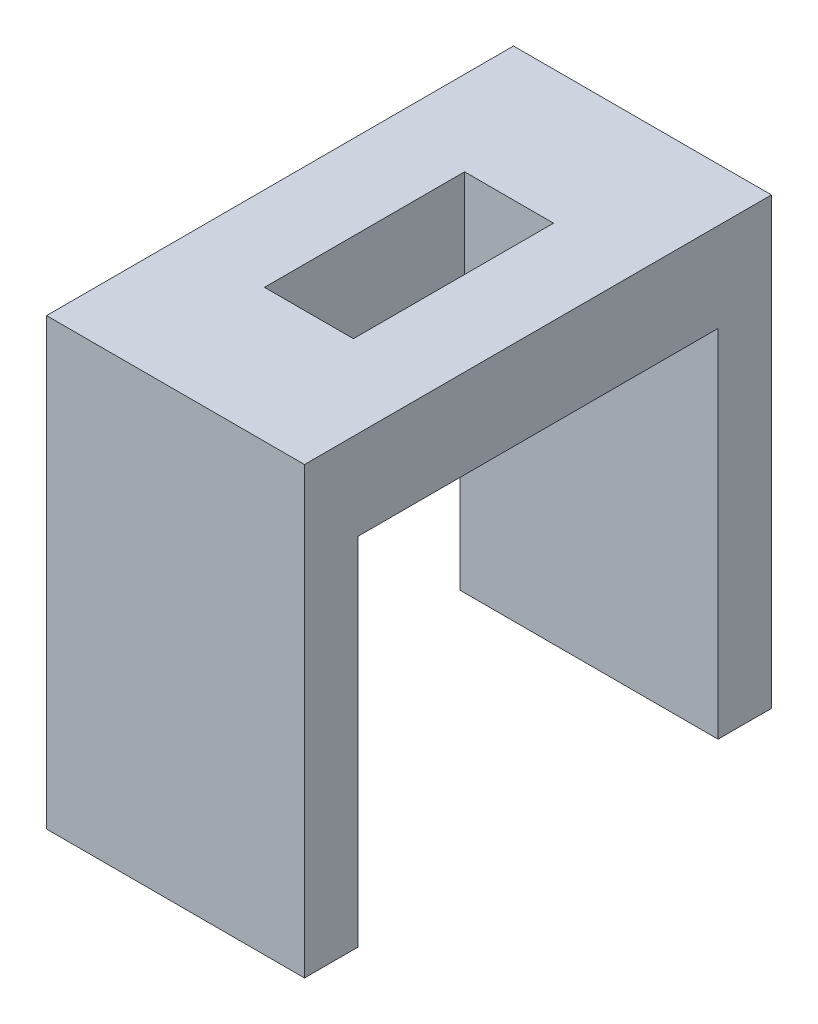
ISO-10303-21;
HEADER;
FILE_DESCRIPTION(('STEP AP214'),'2;1');
FILE_NAME('part.step','',(''),(''),'','','');
FILE_SCHEMA(('AUTOMOTIVE_DESIGN { 1 0 10303 214 1 1 1 1 }'));
ENDSEC;
DATA;
#1=APPLICATION_CONTEXT('core data for automotive mechanical design processes');
#2=APPLICATION_PROTOCOL_DEFINITION('international standard','automotive_design',2000,#1);
#3=PRODUCT_CONTEXT('',#1,'mechanical');
#4=PRODUCT('Part','Part','',(#3));
#5=PRODUCT_RELATED_PRODUCT_CATEGORY('part','',(#4));
#6=PRODUCT_DEFINITION_FORMATION('','',#4);
#7=PRODUCT_DEFINITION_CONTEXT('part definition',#1,'design');
#8=PRODUCT_DEFINITION('design','',#6,#7);
#9=PRODUCT_DEFINITION_SHAPE('','',#8);
#10=(LENGTH_UNIT() NAMED_UNIT(*) SI_UNIT(.MILLI.,.METRE.));
#11=(NAMED_UNIT(*) PLANE_ANGLE_UNIT() SI_UNIT($,.RADIAN.));
#12=(NAMED_UNIT(*) SI_UNIT($,.STERADIAN.) SOLID_ANGLE_UNIT());
#13=UNCERTAINTY_MEASURE_WITH_UNIT(LENGTH_MEASURE(1.E-05),#10,'distance_accuracy_value','');
#14=(GEOMETRIC_REPRESENTATION_CONTEXT(3) GLOBAL_UNCERTAINTY_ASSIGNED_CONTEXT((#13)) GLOBAL_UNIT_ASSIGNED_CONTEXT((#10,
#11,#12)) REPRESENTATION_CONTEXT('',''));
#15=CARTESIAN_POINT('',(0.,0.,0.));
#16=DIRECTION('',(0.,0.,1.));
#17=DIRECTION('',(1.,0.,0.));
#18=AXIS2_PLACEMENT_3D('',#15,#16,#17);
#19=CARTESIAN_POINT('',(0.,0.,0.));
#20=DIRECTION('',(0.,-1.,0.));
#21=DIRECTION('',(0.,0.,-1.));
#22=AXIS2_PLACEMENT_3D('',#19,#20,#21);
#23=PLANE('',#22);
#24=DIRECTION('',(-1.,0.,0.));
#25=VECTOR('',#24,1.);
#26=CARTESIAN_POINT('',(1.9,0.,-7.5));
#27=LINE('',#26,#25);
#28=CARTESIAN_POINT('',(3.9,0.,-7.5));
#29=VERTEX_POINT('',#28);
#30=CARTESIAN_POINT('',(1.9,0.,-7.5));
#31=VERTEX_POINT('',#30);
#32=EDGE_CURVE('E198',#29,#31,#27,.T.);
#33=ORIENTED_EDGE('',*,*,#32,.T.);
#34=DIRECTION('',(0.,0.,1.));
#35=VECTOR('',#34,1.);
#36=CARTESIAN_POINT('',(1.9,0.,-7.5));
#37=LINE('',#36,#35);
#38=CARTESIAN_POINT('',(1.9,0.,-3.));
#39=VERTEX_POINT('',#38);
#40=EDGE_CURVE('E181',#31,#39,#37,.T.);
#41=ORIENTED_EDGE('',*,*,#40,.T.);
#42=DIRECTION('',(1.,0.,0.));
#43=VECTOR('',#42,1.);
#44=CARTESIAN_POINT('',(1.9,0.,-3.));
#45=LINE('',#44,#43);
#46=CARTESIAN_POINT('',(3.9,0.,-3.));
#47=VERTEX_POINT('',#46);
#48=EDGE_CURVE('E185',#39,#47,#45,.T.);
#49=ORIENTED_EDGE('',*,*,#48,.T.);
#50=DIRECTION('',(0.,0.,-1.));
#51=VECTOR('',#50,1.);
#52=CARTESIAN_POINT('',(3.9,0.,-7.5));
#53=LINE('',#52,#51);
#54=EDGE_CURVE('E190',#47,#29,#53,.T.);
#55=ORIENTED_EDGE('',*,*,#54,.T.);
#56=EDGE_LOOP('',(#33,#41,#49,#55));
#57=FACE_BOUND('',#56,.T.);
#58=DIRECTION('',(0.,0.,-1.));
#59=VECTOR('',#58,1.);
#60=CARTESIAN_POINT('',(5.8,0.,0.));
#61=LINE('',#60,#59);
#62=CARTESIAN_POINT('',(5.8,0.,-1.2));
#63=VERTEX_POINT('',#62);
#64=CARTESIAN_POINT('',(5.8,0.,-9.3));
#65=VERTEX_POINT('',#64);
#66=EDGE_CURVE('E37',#63,#65,#61,.T.);
#67=ORIENTED_EDGE('',*,*,#66,.F.);
#68=DIRECTION('',(1.,0.,0.));
#69=VECTOR('',#68,1.);
#70=CARTESIAN_POINT('',(5.8,0.,-1.2));
#71=LINE('',#70,#69);
#72=CARTESIAN_POINT('',(0.,0.,-1.2));
#73=VERTEX_POINT('',#72);
#74=EDGE_CURVE('E143',#73,#63,#71,.T.);
#75=ORIENTED_EDGE('',*,*,#74,.F.);
#76=DIRECTION('',(0.,0.,1.));
#77=VECTOR('',#76,1.);
#78=CARTESIAN_POINT('',(0.,0.,0.));
#79=LINE('',#78,#77);
#80=CARTESIAN_POINT('',(0.,0.,-9.3));
#81=VERTEX_POINT('',#80);
#82=EDGE_CURVE('E173',#81,#73,#79,.T.);
#83=ORIENTED_EDGE('',*,*,#82,.F.);
#84=DIRECTION('',(-1.,0.,0.));
#85=VECTOR('',#84,1.);
#86=CARTESIAN_POINT('',(5.8,0.,-9.3));
#87=LINE('',#86,#85);
#88=EDGE_CURVE('E152',#65,#81,#87,.T.);
#89=ORIENTED_EDGE('',*,*,#88,.F.);
#90=EDGE_LOOP('',(#67,#75,#83,#89));
#91=FACE_BOUND('',#90,.T.);
#92=ADVANCED_FACE('F33',(#57,#91),#23,.T.);
#93=CARTESIAN_POINT('',(0.,2.,0.));
#94=DIRECTION('',(0.,-1.,0.));
#95=DIRECTION('',(0.,0.,-1.));
#96=AXIS2_PLACEMENT_3D('',#93,#94,#95);
#97=PLANE('',#96);
#98=DIRECTION('',(0.,0.,1.));
#99=VECTOR('',#98,1.);
#100=CARTESIAN_POINT('',(0.,2.,0.));
#101=LINE('',#100,#99);
#102=CARTESIAN_POINT('',(0.,2.,-10.5));
#103=VERTEX_POINT('',#102);
#104=CARTESIAN_POINT('',(0.,2.,0.));
#105=VERTEX_POINT('',#104);
#106=EDGE_CURVE('E210',#103,#105,#101,.T.);
#107=ORIENTED_EDGE('',*,*,#106,.T.);
#108=DIRECTION('',(1.,0.,0.));
#109=VECTOR('',#108,1.);
#110=CARTESIAN_POINT('',(0.,2.,0.));
#111=LINE('',#110,#109);
#112=CARTESIAN_POINT('',(5.8,2.,0.));
#113=VERTEX_POINT('',#112);
#114=EDGE_CURVE('E213',#105,#113,#111,.T.);
#115=ORIENTED_EDGE('',*,*,#114,.T.);
#116=DIRECTION('',(0.,0.,-1.));
#117=VECTOR('',#116,1.);
#118=CARTESIAN_POINT('',(5.8,2.,0.));
#119=LINE('',#118,#117);
#120=CARTESIAN_POINT('',(5.8,2.,-10.5));
#121=VERTEX_POINT('',#120);
#122=EDGE_CURVE('E128',#113,#121,#119,.T.);
#123=ORIENTED_EDGE('',*,*,#122,.T.);
#124=DIRECTION('',(-1.,0.,0.));
#125=VECTOR('',#124,1.);
#126=CARTESIAN_POINT('',(0.,2.,-10.5));
#127=LINE('',#126,#125);
#128=EDGE_CURVE('E216',#121,#103,#127,.T.);
#129=ORIENTED_EDGE('',*,*,#128,.T.);
#130=EDGE_LOOP('',(#107,#115,#123,#129));
#131=FACE_BOUND('',#130,.T.);
#132=DIRECTION('',(0.,0.,1.));
#133=VECTOR('',#132,1.);
#134=CARTESIAN_POINT('',(1.9,2.,-7.5));
#135=LINE('',#134,#133);
#136=CARTESIAN_POINT('',(1.9,2.,-7.5));
#137=VERTEX_POINT('',#136);
#138=CARTESIAN_POINT('',(1.9,2.,-3.));
#139=VERTEX_POINT('',#138);
#140=EDGE_CURVE('E167',#137,#139,#135,.T.);
#141=ORIENTED_EDGE('',*,*,#140,.F.);
#142=DIRECTION('',(-1.,0.,0.));
#143=VECTOR('',#142,1.);
#144=CARTESIAN_POINT('',(1.9,2.,-7.5));
#145=LINE('',#144,#143);
#146=CARTESIAN_POINT('',(3.9,2.,-7.5));
#147=VERTEX_POINT('',#146);
#148=EDGE_CURVE('E193',#147,#137,#145,.T.);
#149=ORIENTED_EDGE('',*,*,#148,.F.);
#150=DIRECTION('',(0.,0.,-1.));
#151=VECTOR('',#150,1.);
#152=CARTESIAN_POINT('',(3.9,2.,-7.5));
#153=LINE('',#152,#151);
#154=CARTESIAN_POINT('',(3.9,2.,-3.));
#155=VERTEX_POINT('',#154);
#156=EDGE_CURVE('E248',#155,#147,#153,.T.);
#157=ORIENTED_EDGE('',*,*,#156,.F.);
#158=DIRECTION('',(1.,0.,0.));
#159=VECTOR('',#158,1.);
#160=CARTESIAN_POINT('',(1.9,2.,-3.));
#161=LINE('',#160,#159);
#162=EDGE_CURVE('E244',#139,#155,#161,.T.);
#163=ORIENTED_EDGE('',*,*,#162,.F.);
#164=EDGE_LOOP('',(#141,#149,#157,#163));
#165=FACE_BOUND('',#164,.T.);
#166=ADVANCED_FACE('F236',(#131,#165),#97,.F.);
#167=CARTESIAN_POINT('',(0.,2.,0.));
#168=DIRECTION('',(1.,0.,0.));
#169=DIRECTION('',(0.,0.,-1.));
#170=AXIS2_PLACEMENT_3D('',#167,#168,#169);
#171=PLANE('',#170);
#172=DIRECTION('',(0.,-1.,0.));
#173=VECTOR('',#172,1.);
#174=CARTESIAN_POINT('',(0.,2.,-10.5));
#175=LINE('',#174,#173);
#176=CARTESIAN_POINT('',(0.,-8.,-10.5));
#177=VERTEX_POINT('',#176);
#178=EDGE_CURVE('E217',#103,#177,#175,.T.);
#179=ORIENTED_EDGE('',*,*,#178,.T.);
#180=DIRECTION('',(0.,0.,-1.));
#181=VECTOR('',#180,1.);
#182=CARTESIAN_POINT('',(0.,-8.,-10.5));
#183=LINE('',#182,#181);
#184=CARTESIAN_POINT('',(0.,-8.,-9.3));
#185=VERTEX_POINT('',#184);
#186=EDGE_CURVE('E158',#185,#177,#183,.T.);
#187=ORIENTED_EDGE('',*,*,#186,.F.);
#188=DIRECTION('',(0.,1.,0.));
#189=VECTOR('',#188,1.);
#190=CARTESIAN_POINT('',(0.,-8.,-9.3));
#191=LINE('',#190,#189);
#192=EDGE_CURVE('E164',#185,#81,#191,.T.);
#193=ORIENTED_EDGE('',*,*,#192,.T.);
#194=ORIENTED_EDGE('',*,*,#82,.T.);
#195=DIRECTION('',(0.,1.,0.));
#196=VECTOR('',#195,1.);
#197=CARTESIAN_POINT('',(0.,-8.,-1.2));
#198=LINE('',#197,#196);
#199=CARTESIAN_POINT('',(0.,-8.,-1.2));
#200=VERTEX_POINT('',#199);
#201=EDGE_CURVE('E150',#200,#73,#198,.T.);
#202=ORIENTED_EDGE('',*,*,#201,.F.);
#203=DIRECTION('',(0.,0.,-1.));
#204=VECTOR('',#203,1.);
#205=CARTESIAN_POINT('',(0.,-8.,0.));
#206=LINE('',#205,#204);
#207=CARTESIAN_POINT('',(0.,-8.,0.));
#208=VERTEX_POINT('',#207);
#209=EDGE_CURVE('E138',#208,#200,#206,.T.);
#210=ORIENTED_EDGE('',*,*,#209,.F.);
#211=DIRECTION('',(0.,-1.,0.));
#212=VECTOR('',#211,1.);
#213=CARTESIAN_POINT('',(0.,2.,0.));
#214=LINE('',#213,#212);
#215=EDGE_CURVE('E11',#105,#208,#214,.T.);
#216=ORIENTED_EDGE('',*,*,#215,.F.);
#217=ORIENTED_EDGE('',*,*,#106,.F.);
#218=EDGE_LOOP('',(#179,#187,#193,#194,#202,#210,#216,#217));
#219=FACE_BOUND('',#218,.T.);
#220=ADVANCED_FACE('F35',(#219),#171,.F.);
#221=CARTESIAN_POINT('',(0.,2.,0.));
#222=DIRECTION('',(0.,0.,-1.));
#223=DIRECTION('',(-1.,0.,0.));
#224=AXIS2_PLACEMENT_3D('',#221,#222,#223);
#225=PLANE('',#224);
#226=ORIENTED_EDGE('',*,*,#215,.T.);
#227=DIRECTION('',(-1.,0.,0.));
#228=VECTOR('',#227,1.);
#229=CARTESIAN_POINT('',(5.8,-8.,0.));
#230=LINE('',#229,#228);
#231=CARTESIAN_POINT('',(5.8,-8.,0.));
#232=VERTEX_POINT('',#231);
#233=EDGE_CURVE('E133',#232,#208,#230,.T.);
#234=ORIENTED_EDGE('',*,*,#233,.F.);
#235=DIRECTION('',(0.,-1.,0.));
#236=VECTOR('',#235,1.);
#237=CARTESIAN_POINT('',(5.8,2.,0.));
#238=LINE('',#237,#236);
#239=EDGE_CURVE('E43',#113,#232,#238,.T.);
#240=ORIENTED_EDGE('',*,*,#239,.F.);
#241=ORIENTED_EDGE('',*,*,#114,.F.);
#242=EDGE_LOOP('',(#226,#234,#240,#241));
#243=FACE_BOUND('',#242,.T.);
#244=ADVANCED_FACE('F134',(#243),#225,.F.);
#245=CARTESIAN_POINT('',(5.8,2.,0.));
#246=DIRECTION('',(-1.,0.,0.));
#247=DIRECTION('',(0.,0.,1.));
#248=AXIS2_PLACEMENT_3D('',#245,#246,#247);
#249=PLANE('',#248);
#250=ORIENTED_EDGE('',*,*,#239,.T.);
#251=DIRECTION('',(0.,0.,1.));
#252=VECTOR('',#251,1.);
#253=CARTESIAN_POINT('',(5.8,-8.,0.));
#254=LINE('',#253,#252);
#255=CARTESIAN_POINT('',(5.8,-8.,-1.2));
#256=VERTEX_POINT('',#255);
#257=EDGE_CURVE('E126',#256,#232,#254,.T.);
#258=ORIENTED_EDGE('',*,*,#257,.F.);
#259=DIRECTION('',(0.,1.,0.));
#260=VECTOR('',#259,1.);
#261=CARTESIAN_POINT('',(5.8,-8.,-1.2));
#262=LINE('',#261,#260);
#263=EDGE_CURVE('E51',#256,#63,#262,.T.);
#264=ORIENTED_EDGE('',*,*,#263,.T.);
#265=ORIENTED_EDGE('',*,*,#66,.T.);
#266=DIRECTION('',(0.,1.,0.));
#267=VECTOR('',#266,1.);
#268=CARTESIAN_POINT('',(5.8,-8.,-9.3));
#269=LINE('',#268,#267);
#270=CARTESIAN_POINT('',(5.8,-8.,-9.3));
#271=VERTEX_POINT('',#270);
#272=EDGE_CURVE('E177',#271,#65,#269,.T.);
#273=ORIENTED_EDGE('',*,*,#272,.F.);
#274=DIRECTION('',(0.,0.,1.));
#275=VECTOR('',#274,1.);
#276=CARTESIAN_POINT('',(5.8,-8.,-10.5));
#277=LINE('',#276,#275);
#278=CARTESIAN_POINT('',(5.8,-8.,-10.5));
#279=VERTEX_POINT('',#278);
#280=EDGE_CURVE('E153',#279,#271,#277,.T.);
#281=ORIENTED_EDGE('',*,*,#280,.F.);
#282=DIRECTION('',(0.,-1.,0.));
#283=VECTOR('',#282,1.);
#284=CARTESIAN_POINT('',(5.8,2.,-10.5));
#285=LINE('',#284,#283);
#286=EDGE_CURVE('E130',#121,#279,#285,.T.);
#287=ORIENTED_EDGE('',*,*,#286,.F.);
#288=ORIENTED_EDGE('',*,*,#122,.F.);
#289=EDGE_LOOP('',(#250,#258,#264,#265,#273,#281,#287,#288));
#290=FACE_BOUND('',#289,.T.);
#291=ADVANCED_FACE('F124',(#290),#249,.F.);
#292=CARTESIAN_POINT('',(0.,2.,-10.5));
#293=DIRECTION('',(0.,0.,1.));
#294=DIRECTION('',(1.,0.,0.));
#295=AXIS2_PLACEMENT_3D('',#292,#293,#294);
#296=PLANE('',#295);
#297=ORIENTED_EDGE('',*,*,#286,.T.);
#298=DIRECTION('',(1.,0.,0.));
#299=VECTOR('',#298,1.);
#300=CARTESIAN_POINT('',(5.8,-8.,-10.5));
#301=LINE('',#300,#299);
#302=EDGE_CURVE('E161',#177,#279,#301,.T.);
#303=ORIENTED_EDGE('',*,*,#302,.F.);
#304=ORIENTED_EDGE('',*,*,#178,.F.);
#305=ORIENTED_EDGE('',*,*,#128,.F.);
#306=EDGE_LOOP('',(#297,#303,#304,#305));
#307=FACE_BOUND('',#306,.T.);
#308=ADVANCED_FACE('F225',(#307),#296,.F.);
#309=CARTESIAN_POINT('',(1.9,2.,-7.5));
#310=DIRECTION('',(1.,0.,0.));
#311=DIRECTION('',(0.,0.,-1.));
#312=AXIS2_PLACEMENT_3D('',#309,#310,#311);
#313=PLANE('',#312);
#314=ORIENTED_EDGE('',*,*,#40,.F.);
#315=DIRECTION('',(0.,-1.,0.));
#316=VECTOR('',#315,1.);
#317=CARTESIAN_POINT('',(1.9,2.,-7.5));
#318=LINE('',#317,#316);
#319=EDGE_CURVE('E200',#137,#31,#318,.T.);
#320=ORIENTED_EDGE('',*,*,#319,.F.);
#321=ORIENTED_EDGE('',*,*,#140,.T.);
#322=DIRECTION('',(0.,-1.,0.));
#323=VECTOR('',#322,1.);
#324=CARTESIAN_POINT('',(1.9,2.,-3.));
#325=LINE('',#324,#323);
#326=EDGE_CURVE('E207',#139,#39,#325,.T.);
#327=ORIENTED_EDGE('',*,*,#326,.T.);
#328=EDGE_LOOP('',(#314,#320,#321,#327));
#329=FACE_BOUND('',#328,.T.);
#330=ADVANCED_FACE('F256',(#329),#313,.T.);
#331=CARTESIAN_POINT('',(1.9,2.,-3.));
#332=DIRECTION('',(0.,0.,-1.));
#333=DIRECTION('',(-1.,0.,0.));
#334=AXIS2_PLACEMENT_3D('',#331,#332,#333);
#335=PLANE('',#334);
#336=ORIENTED_EDGE('',*,*,#48,.F.);
#337=ORIENTED_EDGE('',*,*,#326,.F.);
#338=ORIENTED_EDGE('',*,*,#162,.T.);
#339=DIRECTION('',(0.,-1.,0.));
#340=VECTOR('',#339,1.);
#341=CARTESIAN_POINT('',(3.9,2.,-3.));
#342=LINE('',#341,#340);
#343=EDGE_CURVE('E205',#155,#47,#342,.T.);
#344=ORIENTED_EDGE('',*,*,#343,.T.);
#345=EDGE_LOOP('',(#336,#337,#338,#344));
#346=FACE_BOUND('',#345,.T.);
#347=ADVANCED_FACE('F257',(#346),#335,.T.);
#348=CARTESIAN_POINT('',(3.9,2.,-7.5));
#349=DIRECTION('',(-1.,0.,0.));
#350=DIRECTION('',(0.,0.,1.));
#351=AXIS2_PLACEMENT_3D('',#348,#349,#350);
#352=PLANE('',#351);
#353=ORIENTED_EDGE('',*,*,#54,.F.);
#354=ORIENTED_EDGE('',*,*,#343,.F.);
#355=ORIENTED_EDGE('',*,*,#156,.T.);
#356=DIRECTION('',(0.,-1.,0.));
#357=VECTOR('',#356,1.);
#358=CARTESIAN_POINT('',(3.9,2.,-7.5));
#359=LINE('',#358,#357);
#360=EDGE_CURVE('E203',#147,#29,#359,.T.);
#361=ORIENTED_EDGE('',*,*,#360,.T.);
#362=EDGE_LOOP('',(#353,#354,#355,#361));
#363=FACE_BOUND('',#362,.T.);
#364=ADVANCED_FACE('F260',(#363),#352,.T.);
#365=CARTESIAN_POINT('',(1.9,2.,-7.5));
#366=DIRECTION('',(0.,0.,1.));
#367=DIRECTION('',(1.,0.,0.));
#368=AXIS2_PLACEMENT_3D('',#365,#366,#367);
#369=PLANE('',#368);
#370=ORIENTED_EDGE('',*,*,#32,.F.);
#371=ORIENTED_EDGE('',*,*,#360,.F.);
#372=ORIENTED_EDGE('',*,*,#148,.T.);
#373=ORIENTED_EDGE('',*,*,#319,.T.);
#374=EDGE_LOOP('',(#370,#371,#372,#373));
#375=FACE_BOUND('',#374,.T.);
#376=ADVANCED_FACE('F255',(#375),#369,.T.);
#377=CARTESIAN_POINT('',(5.8,-8.,-9.3));
#378=DIRECTION('',(0.,0.,-1.));
#379=DIRECTION('',(-1.,0.,0.));
#380=AXIS2_PLACEMENT_3D('',#377,#378,#379);
#381=PLANE('',#380);
#382=ORIENTED_EDGE('',*,*,#88,.T.);
#383=ORIENTED_EDGE('',*,*,#192,.F.);
#384=DIRECTION('',(-1.,0.,0.));
#385=VECTOR('',#384,1.);
#386=CARTESIAN_POINT('',(5.8,-8.,-9.3));
#387=LINE('',#386,#385);
#388=EDGE_CURVE('E156',#271,#185,#387,.T.);
#389=ORIENTED_EDGE('',*,*,#388,.F.);
#390=ORIENTED_EDGE('',*,*,#272,.T.);
#391=EDGE_LOOP('',(#382,#383,#389,#390));
#392=FACE_BOUND('',#391,.T.);
#393=ADVANCED_FACE('F267',(#392),#381,.F.);
#394=CARTESIAN_POINT('',(0.,-8.,0.));
#395=DIRECTION('',(0.,-1.,0.));
#396=DIRECTION('',(0.,0.,-1.));
#397=AXIS2_PLACEMENT_3D('',#394,#395,#396);
#398=PLANE('',#397);
#399=ORIENTED_EDGE('',*,*,#280,.T.);
#400=ORIENTED_EDGE('',*,*,#388,.T.);
#401=ORIENTED_EDGE('',*,*,#186,.T.);
#402=ORIENTED_EDGE('',*,*,#302,.T.);
#403=EDGE_LOOP('',(#399,#400,#401,#402));
#404=FACE_BOUND('',#403,.T.);
#405=ADVANCED_FACE('F229',(#404),#398,.T.);
#406=CARTESIAN_POINT('',(5.8,-8.,-1.2));
#407=DIRECTION('',(0.,0.,1.));
#408=DIRECTION('',(1.,0.,0.));
#409=AXIS2_PLACEMENT_3D('',#406,#407,#408);
#410=PLANE('',#409);
#411=ORIENTED_EDGE('',*,*,#74,.T.);
#412=ORIENTED_EDGE('',*,*,#263,.F.);
#413=DIRECTION('',(1.,0.,0.));
#414=VECTOR('',#413,1.);
#415=CARTESIAN_POINT('',(5.8,-8.,-1.2));
#416=LINE('',#415,#414);
#417=EDGE_CURVE('E142',#200,#256,#416,.T.);
#418=ORIENTED_EDGE('',*,*,#417,.F.);
#419=ORIENTED_EDGE('',*,*,#201,.T.);
#420=EDGE_LOOP('',(#411,#412,#418,#419));
#421=FACE_BOUND('',#420,.T.);
#422=ADVANCED_FACE('F367',(#421),#410,.F.);
#423=CARTESIAN_POINT('',(0.,-8.,0.));
#424=DIRECTION('',(0.,1.,0.));
#425=DIRECTION('',(0.,0.,1.));
#426=AXIS2_PLACEMENT_3D('',#423,#424,#425);
#427=PLANE('',#426);
#428=ORIENTED_EDGE('',*,*,#257,.T.);
#429=ORIENTED_EDGE('',*,*,#233,.T.);
#430=ORIENTED_EDGE('',*,*,#209,.T.);
#431=ORIENTED_EDGE('',*,*,#417,.T.);
#432=EDGE_LOOP('',(#428,#429,#430,#431));
#433=FACE_BOUND('',#432,.T.);
#434=ADVANCED_FACE('F140',(#433),#427,.F.);
#435=CLOSED_SHELL('',(#92,#166,#220,#244,#291,#308,#330,#347,#364,#376,#393,#405,#422,#434));
#436=MANIFOLD_SOLID_BREP('B2',#435);
#437=ADVANCED_BREP_SHAPE_REPRESENTATION('',(#18,#436),#14);
#438=SHAPE_DEFINITION_REPRESENTATION(#9,#437);
ENDSEC;
END-ISO-10303-21;
